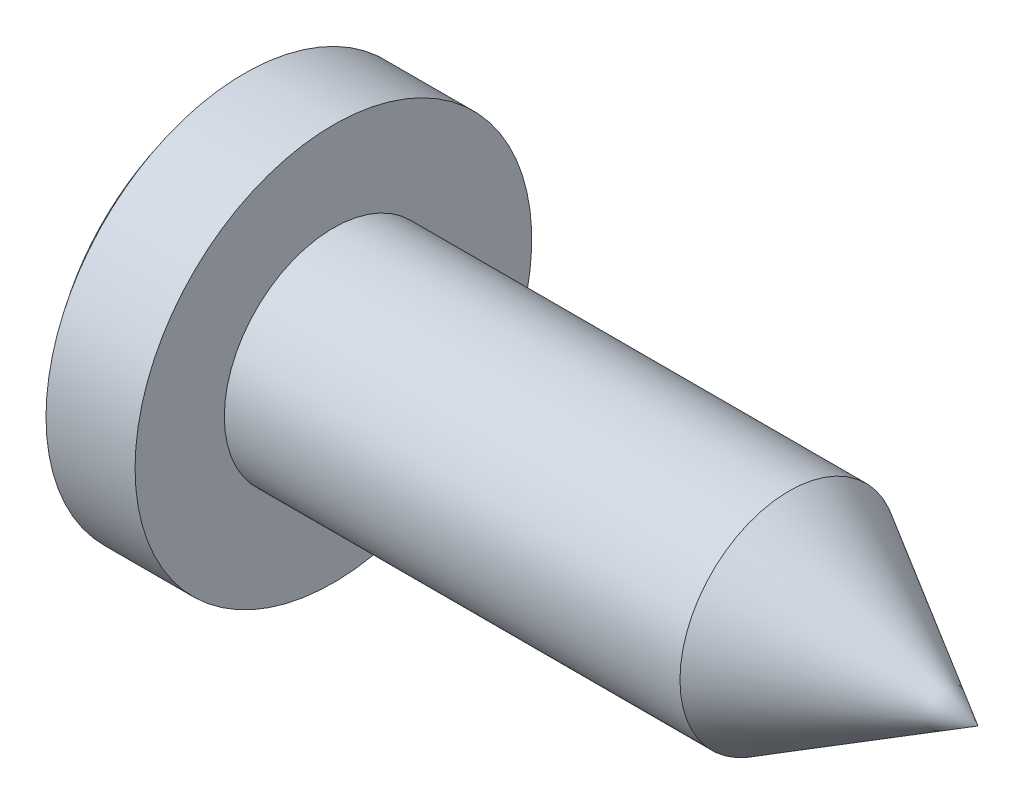
ISO-10303-21;
HEADER;
FILE_DESCRIPTION(('STEP AP214'),'2;1');
FILE_NAME('part.step','',(''),(''),'','','');
FILE_SCHEMA(('AUTOMOTIVE_DESIGN { 1 0 10303 214 1 1 1 1 }'));
ENDSEC;
DATA;
#1=APPLICATION_CONTEXT('core data for automotive mechanical design processes');
#2=APPLICATION_PROTOCOL_DEFINITION('international standard','automotive_design',2000,#1);
#3=PRODUCT_CONTEXT('',#1,'mechanical');
#4=PRODUCT('Part','Part','',(#3));
#5=PRODUCT_RELATED_PRODUCT_CATEGORY('part','',(#4));
#6=PRODUCT_DEFINITION_FORMATION('','',#4);
#7=PRODUCT_DEFINITION_CONTEXT('part definition',#1,'design');
#8=PRODUCT_DEFINITION('design','',#6,#7);
#9=PRODUCT_DEFINITION_SHAPE('','',#8);
#10=(LENGTH_UNIT() NAMED_UNIT(*) SI_UNIT(.MILLI.,.METRE.));
#11=(NAMED_UNIT(*) PLANE_ANGLE_UNIT() SI_UNIT($,.RADIAN.));
#12=(NAMED_UNIT(*) SI_UNIT($,.STERADIAN.) SOLID_ANGLE_UNIT());
#13=UNCERTAINTY_MEASURE_WITH_UNIT(LENGTH_MEASURE(1.E-05),#10,'distance_accuracy_value','');
#14=(GEOMETRIC_REPRESENTATION_CONTEXT(3) GLOBAL_UNCERTAINTY_ASSIGNED_CONTEXT((#13)) GLOBAL_UNIT_ASSIGNED_CONTEXT((#10,
#11,#12)) REPRESENTATION_CONTEXT('',''));
#15=CARTESIAN_POINT('',(0.,0.,0.));
#16=DIRECTION('',(0.,0.,1.));
#17=DIRECTION('',(1.,0.,0.));
#18=AXIS2_PLACEMENT_3D('',#15,#16,#17);
#19=CARTESIAN_POINT('',(1.6,0.,0.));
#20=DIRECTION('',(-1.,0.,0.));
#21=DIRECTION('',(0.,1.,0.));
#22=AXIS2_PLACEMENT_3D('',#19,#20,#21);
#23=SPHERICAL_SURFACE('',#22,3.2);
#24=CARTESIAN_POINT('',(-0.89799919935936,0.,0.));
#25=DIRECTION('',(-1.,0.,0.));
#26=DIRECTION('',(0.,0.,1.));
#27=AXIS2_PLACEMENT_3D('',#24,#25,#26);
#28=CIRCLE('',#27,2.);
#29=CARTESIAN_POINT('',(-0.89799919935936,0.,2.));
#30=VERTEX_POINT('',#29);
#31=EDGE_CURVE('E289',#30,#30,#28,.T.);
#32=ORIENTED_EDGE('',*,*,#31,.T.);
#33=EDGE_LOOP('',(#32));
#34=FACE_BOUND('',#33,.T.);
#35=CARTESIAN_POINT('',(1.56503616117409,0.0806815870157537,0.322726348063015));
#36=DIRECTION('',(0.104528463267654,-0.241206989505462,-0.964827958021851));
#37=DIRECTION('',(0.,0.970142500145332,-0.242535625036333));
#38=AXIS2_PLACEMENT_3D('',#35,#36,#37);
#39=CIRCLE('',#38,3.18247006517848);
#40=CARTESIAN_POINT('',(-1.45274996309991,0.934523397478773,-0.217677932639515));
#41=VERTEX_POINT('',#40);
#42=CARTESIAN_POINT('',(-1.54602165644221,0.569150220513997,-0.136439597205102));
#43=VERTEX_POINT('',#42);
#44=EDGE_CURVE('E11',#41,#43,#39,.F.);
#45=ORIENTED_EDGE('',*,*,#44,.F.);
#46=CARTESIAN_POINT('',(1.66379421431252,0.606961405040141,0.));
#47=DIRECTION('',(0.104528463267654,0.994521895368273,0.));
#48=DIRECTION('',(-0.994521895368273,0.104528463267654,0.));
#49=AXIS2_PLACEMENT_3D('',#46,#47,#48);
#50=CIRCLE('',#49,3.14126219074625);
#51=CARTESIAN_POINT('',(-1.45274996309991,0.934523397478773,0.217677932639514));
#52=VERTEX_POINT('',#51);
#53=EDGE_CURVE('E44',#52,#41,#50,.F.);
#54=ORIENTED_EDGE('',*,*,#53,.F.);
#55=CARTESIAN_POINT('',(1.56503616117409,0.0806815870157537,-0.322726348063015));
#56=DIRECTION('',(0.104528463267654,-0.241206989505462,0.964827958021851));
#57=DIRECTION('',(0.,-0.970142500145332,-0.242535625036333));
#58=AXIS2_PLACEMENT_3D('',#55,#56,#57);
#59=CIRCLE('',#58,3.18247006517848);
#60=CARTESIAN_POINT('',(-1.54602165644221,0.569150220513997,0.136439597205102));
#61=VERTEX_POINT('',#60);
#62=EDGE_CURVE('E329',#61,#52,#59,.F.);
#63=ORIENTED_EDGE('',*,*,#62,.F.);
#64=CARTESIAN_POINT('',(1.60749262454255,0.0356437803082174,0.061736838467657));
#65=DIRECTION('',(0.104528463267654,0.497260947684129,0.861281226008779));
#66=DIRECTION('',(0.,-0.866025403784443,0.499999999999992));
#67=AXIS2_PLACEMENT_3D('',#64,#65,#66);
#68=CIRCLE('',#67,3.19919707806175);
#69=CARTESIAN_POINT('',(-1.57234339721419,0.296847915734236,0.296847915734238));
#70=VERTEX_POINT('',#69);
#71=EDGE_CURVE('E327',#70,#61,#68,.F.);
#72=ORIENTED_EDGE('',*,*,#71,.F.);
#73=CARTESIAN_POINT('',(1.60749262454255,0.0617368384676551,0.0356437803082149));
#74=DIRECTION('',(0.104528463267654,0.861281226008787,0.497260947684114));
#75=DIRECTION('',(0.,-0.499999999999977,0.866025403784452));
#76=AXIS2_PLACEMENT_3D('',#73,#74,#75);
#77=CIRCLE('',#76,3.19919707806175);
#78=CARTESIAN_POINT('',(-1.54602165644221,0.136439597205108,0.569150220513995));
#79=VERTEX_POINT('',#78);
#80=EDGE_CURVE('E325',#79,#70,#77,.F.);
#81=ORIENTED_EDGE('',*,*,#80,.F.);
#82=CARTESIAN_POINT('',(1.56503616117409,-0.322726348063014,0.0806815870157571));
#83=DIRECTION('',(0.104528463267654,0.964827958021848,-0.241206989505473));
#84=DIRECTION('',(0.,0.242535625036343,0.970142500145329));
#85=AXIS2_PLACEMENT_3D('',#82,#83,#84);
#86=CIRCLE('',#85,3.18247006517848);
#87=CARTESIAN_POINT('',(-1.45274996309991,0.217677932639524,0.934523397478771));
#88=VERTEX_POINT('',#87);
#89=EDGE_CURVE('E323',#88,#79,#86,.F.);
#90=ORIENTED_EDGE('',*,*,#89,.F.);
#91=CARTESIAN_POINT('',(1.66379421431252,0.,0.606961405040141));
#92=DIRECTION('',(0.104528463267654,0.,0.994521895368273));
#93=DIRECTION('',(0.994521895368273,0.,-0.104528463267654));
#94=AXIS2_PLACEMENT_3D('',#91,#92,#93);
#95=CIRCLE('',#94,3.14126219074625);
#96=CARTESIAN_POINT('',(-1.45274996309991,-0.217677932639505,0.934523397478775));
#97=VERTEX_POINT('',#96);
#98=EDGE_CURVE('E321',#97,#88,#95,.F.);
#99=ORIENTED_EDGE('',*,*,#98,.F.);
#100=CARTESIAN_POINT('',(1.56503616117409,0.322726348063016,0.0806815870157503));
#101=DIRECTION('',(0.104528463267654,-0.964827958021853,-0.241206989505452));
#102=DIRECTION('',(0.,0.242535625036323,-0.970142500145334));
#103=AXIS2_PLACEMENT_3D('',#100,#101,#102);
#104=CIRCLE('',#103,3.18247006517848);
#105=CARTESIAN_POINT('',(-1.54602165644221,-0.136439597205096,0.569150220513998));
#106=VERTEX_POINT('',#105);
#107=EDGE_CURVE('E319',#106,#97,#104,.F.);
#108=ORIENTED_EDGE('',*,*,#107,.F.);
#109=CARTESIAN_POINT('',(1.60749262454255,-0.0617368384676559,0.0356437803082175));
#110=DIRECTION('',(0.104528463267654,-0.861281226008775,0.497260947684136));
#111=DIRECTION('',(0.,-0.499999999999999,-0.866025403784439));
#112=AXIS2_PLACEMENT_3D('',#109,#110,#111);
#113=CIRCLE('',#112,3.19919707806175);
#114=CARTESIAN_POINT('',(-1.57234339721419,-0.296847915734233,0.296847915734241));
#115=VERTEX_POINT('',#114);
#116=EDGE_CURVE('E317',#115,#106,#113,.F.);
#117=ORIENTED_EDGE('',*,*,#116,.F.);
#118=CARTESIAN_POINT('',(1.60749262454255,-0.035643780308217,0.0617368384676573));
#119=DIRECTION('',(0.104528463267654,-0.497260947684123,0.861281226008782));
#120=DIRECTION('',(0.,-0.866025403784447,-0.499999999999986));
#121=AXIS2_PLACEMENT_3D('',#118,#119,#120);
#122=CIRCLE('',#121,3.19919707806175);
#123=CARTESIAN_POINT('',(-1.54602165644221,-0.569150220513996,0.136439597205106));
#124=VERTEX_POINT('',#123);
#125=EDGE_CURVE('E315',#124,#115,#122,.F.);
#126=ORIENTED_EDGE('',*,*,#125,.F.);
#127=CARTESIAN_POINT('',(1.56503616117409,-0.0806815870157559,-0.322726348063015));
#128=DIRECTION('',(0.104528463267654,0.241206989505469,0.964827958021849));
#129=DIRECTION('',(0.,-0.97014250014533,0.242535625036339));
#130=AXIS2_PLACEMENT_3D('',#127,#128,#129);
#131=CIRCLE('',#130,3.18247006517848);
#132=CARTESIAN_POINT('',(-1.45274996309991,-0.934523397478772,0.217677932639521));
#133=VERTEX_POINT('',#132);
#134=EDGE_CURVE('E313',#133,#124,#131,.F.);
#135=ORIENTED_EDGE('',*,*,#134,.F.);
#136=CARTESIAN_POINT('',(1.66379421431252,-0.606961405040141,0.));
#137=DIRECTION('',(0.104528463267654,-0.994521895368273,0.));
#138=DIRECTION('',(0.994521895368273,0.104528463267654,0.));
#139=AXIS2_PLACEMENT_3D('',#136,#137,#138);
#140=CIRCLE('',#139,3.14126219074625);
#141=CARTESIAN_POINT('',(-1.45274996309991,-0.934523397478775,-0.217677932639508));
#142=VERTEX_POINT('',#141);
#143=EDGE_CURVE('E311',#142,#133,#140,.F.);
#144=ORIENTED_EDGE('',*,*,#143,.F.);
#145=CARTESIAN_POINT('',(1.56503616117409,-0.0806815870157514,0.322726348063016));
#146=DIRECTION('',(0.104528463267654,0.241206989505456,-0.964827958021853));
#147=DIRECTION('',(0.,0.970142500145334,0.242535625036326));
#148=AXIS2_PLACEMENT_3D('',#145,#146,#147);
#149=CIRCLE('',#148,3.18247006517848);
#150=CARTESIAN_POINT('',(-1.54602165644221,-0.569150220513998,-0.136439597205098));
#151=VERTEX_POINT('',#150);
#152=EDGE_CURVE('E309',#151,#142,#149,.F.);
#153=ORIENTED_EDGE('',*,*,#152,.F.);
#154=CARTESIAN_POINT('',(1.60749262454255,-0.0356437803082212,-0.0617368384676608));
#155=DIRECTION('',(0.104528463267654,-0.497260947684145,-0.861281226008769));
#156=DIRECTION('',(0.,0.866025403784434,-0.500000000000009));
#157=AXIS2_PLACEMENT_3D('',#154,#155,#156);
#158=CIRCLE('',#157,3.19919707806175);
#159=CARTESIAN_POINT('',(-1.57234339721419,-0.296847915734241,-0.296847915734239));
#160=VERTEX_POINT('',#159);
#161=EDGE_CURVE('E307',#160,#151,#158,.F.);
#162=ORIENTED_EDGE('',*,*,#161,.F.);
#163=CARTESIAN_POINT('',(1.60749262454255,-0.0617368384676612,-0.0356437803082206));
#164=DIRECTION('',(0.104528463267654,-0.861281226008774,-0.497260947684136));
#165=DIRECTION('',(0.,0.5,-0.866025403784439));
#166=AXIS2_PLACEMENT_3D('',#163,#164,#165);
#167=CIRCLE('',#166,3.19919707806175);
#168=CARTESIAN_POINT('',(-1.54602165644221,-0.136439597205104,-0.569150220513996));
#169=VERTEX_POINT('',#168);
#170=EDGE_CURVE('E305',#169,#160,#167,.F.);
#171=ORIENTED_EDGE('',*,*,#170,.F.);
#172=CARTESIAN_POINT('',(1.56503616117409,0.322726348063015,-0.0806815870157548));
#173=DIRECTION('',(0.104528463267654,-0.96482795802185,0.241206989505466));
#174=DIRECTION('',(0.,-0.242535625036336,-0.970142500145331));
#175=AXIS2_PLACEMENT_3D('',#172,#173,#174);
#176=CIRCLE('',#175,3.18247006517848);
#177=CARTESIAN_POINT('',(-1.45274996309991,-0.217677932639518,-0.934523397478772));
#178=VERTEX_POINT('',#177);
#179=EDGE_CURVE('E303',#178,#169,#176,.F.);
#180=ORIENTED_EDGE('',*,*,#179,.F.);
#181=CARTESIAN_POINT('',(1.66379421431252,0.,-0.606961405040141));
#182=DIRECTION('',(0.104528463267654,0.,-0.994521895368273));
#183=DIRECTION('',(-0.994521895368273,0.,-0.104528463267654));
#184=AXIS2_PLACEMENT_3D('',#181,#182,#183);
#185=CIRCLE('',#184,3.14126219074625);
#186=CARTESIAN_POINT('',(-1.45274996309991,0.217677932639511,-0.934523397478774));
#187=VERTEX_POINT('',#186);
#188=EDGE_CURVE('E301',#187,#178,#185,.F.);
#189=ORIENTED_EDGE('',*,*,#188,.F.);
#190=CARTESIAN_POINT('',(1.56503616117409,-0.322726348063015,-0.0806815870157525));
#191=DIRECTION('',(0.104528463267654,0.964827958021852,0.241206989505459));
#192=DIRECTION('',(0.,-0.242535625036329,0.970142500145333));
#193=AXIS2_PLACEMENT_3D('',#190,#191,#192);
#194=CIRCLE('',#193,3.18247006517848);
#195=CARTESIAN_POINT('',(-1.54602165644221,0.1364395972051,-0.569150220513997));
#196=VERTEX_POINT('',#195);
#197=EDGE_CURVE('E299',#196,#187,#194,.F.);
#198=ORIENTED_EDGE('',*,*,#197,.F.);
#199=CARTESIAN_POINT('',(1.60749262454255,0.0617368384676561,-0.035643780308217));
#200=DIRECTION('',(0.104528463267654,0.861281226008778,-0.497260947684129));
#201=DIRECTION('',(0.,0.499999999999993,0.866025403784443));
#202=AXIS2_PLACEMENT_3D('',#199,#200,#201);
#203=CIRCLE('',#202,3.19919707806175);
#204=CARTESIAN_POINT('',(-1.57234339721419,0.296847915734236,-0.296847915734239));
#205=VERTEX_POINT('',#204);
#206=EDGE_CURVE('E297',#205,#196,#203,.F.);
#207=ORIENTED_EDGE('',*,*,#206,.F.);
#208=CARTESIAN_POINT('',(1.60749262454255,0.0356437803082174,-0.061736838467657));
#209=DIRECTION('',(0.104528463267654,0.497260947684129,-0.861281226008779));
#210=DIRECTION('',(0.,0.866025403784443,0.499999999999992));
#211=AXIS2_PLACEMENT_3D('',#208,#209,#210);
#212=CIRCLE('',#211,3.19919707806175);
#213=EDGE_CURVE('E295',#43,#205,#212,.F.);
#214=ORIENTED_EDGE('',*,*,#213,.F.);
#215=EDGE_LOOP('',(#45,#54,#63,#72,#81,#90,#99,#108,#117,#126,#135,#144,#153,#162,#171,#180,
#189,#198,#207,#214));
#216=FACE_BOUND('',#215,.T.);
#217=ADVANCED_FACE('F36',(#34,#216),#23,.T.);
#218=CARTESIAN_POINT('',(0.,0.,0.));
#219=DIRECTION('',(-1.,0.,0.));
#220=DIRECTION('',(0.,0.,1.));
#221=AXIS2_PLACEMENT_3D('',#218,#219,#220);
#222=CYLINDRICAL_SURFACE('',#221,1.1);
#223=CARTESIAN_POINT('',(0.,0.,0.));
#224=DIRECTION('',(-1.,0.,0.));
#225=DIRECTION('',(0.,0.,1.));
#226=AXIS2_PLACEMENT_3D('',#223,#224,#225);
#227=CIRCLE('',#226,1.1);
#228=CARTESIAN_POINT('',(0.,0.,1.1));
#229=VERTEX_POINT('',#228);
#230=EDGE_CURVE('E196',#229,#229,#227,.T.);
#231=ORIENTED_EDGE('',*,*,#230,.F.);
#232=EDGE_LOOP('',(#231));
#233=FACE_BOUND('',#232,.T.);
#234=CARTESIAN_POINT('',(4.59474411167421,0.,0.));
#235=DIRECTION('',(-1.,0.,0.));
#236=DIRECTION('',(0.,0.,1.));
#237=AXIS2_PLACEMENT_3D('',#234,#235,#236);
#238=CIRCLE('',#237,1.1);
#239=CARTESIAN_POINT('',(4.59474411167421,0.,1.1));
#240=VERTEX_POINT('',#239);
#241=EDGE_CURVE('E192',#240,#240,#238,.T.);
#242=ORIENTED_EDGE('',*,*,#241,.T.);
#243=EDGE_LOOP('',(#242));
#244=FACE_BOUND('',#243,.T.);
#245=ADVANCED_FACE('F425',(#233,#244),#222,.T.);
#246=CARTESIAN_POINT('',(0.,1.1,0.));
#247=DIRECTION('',(-1.,0.,0.));
#248=DIRECTION('',(0.,0.,1.));
#249=AXIS2_PLACEMENT_3D('',#246,#247,#248);
#250=PLANE('',#249);
#251=CARTESIAN_POINT('',(0.,0.,0.));
#252=DIRECTION('',(-1.,0.,0.));
#253=DIRECTION('',(0.,0.,1.));
#254=AXIS2_PLACEMENT_3D('',#251,#252,#253);
#255=CIRCLE('',#254,2.);
#256=CARTESIAN_POINT('',(0.,0.,2.));
#257=VERTEX_POINT('',#256);
#258=EDGE_CURVE('E292',#257,#257,#255,.T.);
#259=ORIENTED_EDGE('',*,*,#258,.F.);
#260=EDGE_LOOP('',(#259));
#261=FACE_BOUND('',#260,.T.);
#262=ORIENTED_EDGE('',*,*,#230,.T.);
#263=EDGE_LOOP('',(#262));
#264=FACE_BOUND('',#263,.T.);
#265=ADVANCED_FACE('F38',(#261,#264),#250,.F.);
#266=CARTESIAN_POINT('',(0.,0.,0.));
#267=DIRECTION('',(-1.,0.,0.));
#268=DIRECTION('',(0.,0.,1.));
#269=AXIS2_PLACEMENT_3D('',#266,#267,#268);
#270=CYLINDRICAL_SURFACE('',#269,2.);
#271=ORIENTED_EDGE('',*,*,#31,.F.);
#272=EDGE_LOOP('',(#271));
#273=FACE_BOUND('',#272,.T.);
#274=ORIENTED_EDGE('',*,*,#258,.T.);
#275=EDGE_LOOP('',(#274));
#276=FACE_BOUND('',#275,.T.);
#277=ADVANCED_FACE('F434',(#273,#276),#270,.T.);
#278=CARTESIAN_POINT('',(4.59474411167421,0.,0.));
#279=DIRECTION('',(-1.,0.,0.));
#280=DIRECTION('',(0.,0.,1.));
#281=AXIS2_PLACEMENT_3D('',#278,#279,#280);
#282=CONICAL_SURFACE('',#281,1.1,0.523598775598293);
#283=CARTESIAN_POINT('',(6.5,0.,0.));
#284=VERTEX_POINT('',#283);
#285=VERTEX_LOOP('',#284);
#286=FACE_BOUND('',#285,.T.);
#287=ORIENTED_EDGE('',*,*,#241,.F.);
#288=EDGE_LOOP('',(#287));
#289=FACE_BOUND('',#288,.T.);
#290=ADVANCED_FACE('F436',(#286,#289),#282,.T.);
#291=CARTESIAN_POINT('',(-1.6,0.95,-0.2375));
#292=DIRECTION('',(0.104528463267654,-0.241206989505462,-0.964827958021851));
#293=DIRECTION('',(0.,0.970142500145332,-0.242535625036333));
#294=AXIS2_PLACEMENT_3D('',#291,#292,#293);
#295=PLANE('',#294);
#296=ORIENTED_EDGE('',*,*,#44,.T.);
#297=DIRECTION('',(-0.993634572314887,0.0156427600493606,-0.111560032084303));
#298=VECTOR('',#297,1.);
#299=CARTESIAN_POINT('',(-1.6,0.57,-0.1425));
#300=LINE('',#299,#298);
#301=CARTESIAN_POINT('',(-0.75,0.556618474827239,-0.0470664976705276));
#302=VERTEX_POINT('',#301);
#303=EDGE_CURVE('E51',#302,#43,#300,.T.);
#304=ORIENTED_EDGE('',*,*,#303,.F.);
#305=DIRECTION('',(0.,-0.970142500145332,0.242535625036333));
#306=VECTOR('',#305,1.);
#307=CARTESIAN_POINT('',(-0.75,0.0216677931850071,0.0866711727400304));
#308=LINE('',#307,#306);
#309=CARTESIAN_POINT('',(-0.75,0.860661400024174,-0.123077228969761));
#310=VERTEX_POINT('',#309);
#311=EDGE_CURVE('E176',#302,#310,#308,.F.);
#312=ORIENTED_EDGE('',*,*,#311,.T.);
#313=DIRECTION('',(-0.985727427293419,0.103604127426078,-0.132693722013437));
#314=VECTOR('',#313,1.);
#315=CARTESIAN_POINT('',(-1.53787007542131,0.943469881790042,-0.229136378665655));
#316=LINE('',#315,#314);
#317=EDGE_CURVE('E187',#310,#41,#316,.T.);
#318=ORIENTED_EDGE('',*,*,#317,.T.);
#319=EDGE_LOOP('',(#296,#304,#312,#318));
#320=FACE_BOUND('',#319,.T.);
#321=ADVANCED_FACE('F186',(#320),#295,.F.);
#322=CARTESIAN_POINT('',(-1.6,0.95,0.2375));
#323=DIRECTION('',(0.104528463267654,0.994521895368273,0.));
#324=DIRECTION('',(-0.994521895368273,0.104528463267654,0.));
#325=AXIS2_PLACEMENT_3D('',#322,#323,#324);
#326=PLANE('',#325);
#327=ORIENTED_EDGE('',*,*,#53,.T.);
#328=ORIENTED_EDGE('',*,*,#317,.F.);
#329=DIRECTION('',(0.,0.,-1.));
#330=VECTOR('',#329,1.);
#331=CARTESIAN_POINT('',(-0.75,0.860661400024175,0.));
#332=LINE('',#331,#330);
#333=CARTESIAN_POINT('',(-0.75,0.860661400024174,0.123077228969761));
#334=VERTEX_POINT('',#333);
#335=EDGE_CURVE('E172',#310,#334,#332,.F.);
#336=ORIENTED_EDGE('',*,*,#335,.T.);
#337=DIRECTION('',(-0.985727427293419,0.103604127426078,0.132693722013437));
#338=VECTOR('',#337,1.);
#339=CARTESIAN_POINT('',(-1.6,0.95,0.2375));
#340=LINE('',#339,#338);
#341=EDGE_CURVE('E193',#334,#52,#340,.T.);
#342=ORIENTED_EDGE('',*,*,#341,.T.);
#343=EDGE_LOOP('',(#327,#328,#336,#342));
#344=FACE_BOUND('',#343,.T.);
#345=ADVANCED_FACE('F190',(#344),#326,.F.);
#346=CARTESIAN_POINT('',(-1.6,0.95,0.2375));
#347=DIRECTION('',(0.104528463267654,-0.241206989505462,0.964827958021851));
#348=DIRECTION('',(0.,-0.970142500145332,-0.242535625036333));
#349=AXIS2_PLACEMENT_3D('',#346,#347,#348);
#350=PLANE('',#349);
#351=ORIENTED_EDGE('',*,*,#62,.T.);
#352=ORIENTED_EDGE('',*,*,#341,.F.);
#353=DIRECTION('',(0.,0.970142500145332,0.242535625036333));
#354=VECTOR('',#353,1.);
#355=CARTESIAN_POINT('',(-0.75,0.0216677931850069,-0.0866711727400304));
#356=LINE('',#355,#354);
#357=CARTESIAN_POINT('',(-0.75,0.556618474827239,0.0470664976705276));
#358=VERTEX_POINT('',#357);
#359=EDGE_CURVE('E178',#334,#358,#356,.F.);
#360=ORIENTED_EDGE('',*,*,#359,.T.);
#361=DIRECTION('',(-0.993634572314887,0.0156427600493606,0.111560032084303));
#362=VECTOR('',#361,1.);
#363=CARTESIAN_POINT('',(-1.61643715208567,0.57025876960518,0.14434547646101));
#364=LINE('',#363,#362);
#365=EDGE_CURVE('E198',#358,#61,#364,.T.);
#366=ORIENTED_EDGE('',*,*,#365,.T.);
#367=EDGE_LOOP('',(#351,#352,#360,#366));
#368=FACE_BOUND('',#367,.T.);
#369=ADVANCED_FACE('F332',(#368),#350,.F.);
#370=CARTESIAN_POINT('',(-1.6,0.57,0.1425));
#371=DIRECTION('',(0.104528463267654,0.497260947684129,0.861281226008779));
#372=DIRECTION('',(0.,-0.866025403784443,0.499999999999992));
#373=AXIS2_PLACEMENT_3D('',#370,#371,#372);
#374=PLANE('',#373);
#375=ORIENTED_EDGE('',*,*,#71,.T.);
#376=ORIENTED_EDGE('',*,*,#365,.F.);
#377=DIRECTION('',(0.,0.866025403784443,-0.499999999999992));
#378=VECTOR('',#377,1.);
#379=CARTESIAN_POINT('',(-0.75,0.159535010031724,0.276322742960963));
#380=LINE('',#379,#378);
#381=CARTESIAN_POINT('',(-0.75,0.233575465858467,0.233575465858471));
#382=VERTEX_POINT('',#381);
#383=EDGE_CURVE('E254',#358,#382,#380,.F.);
#384=ORIENTED_EDGE('',*,*,#383,.T.);
#385=DIRECTION('',(-0.994132040497618,0.0764901498757915,0.0764901498757902));
#386=VECTOR('',#385,1.);
#387=CARTESIAN_POINT('',(-1.60871040111109,0.299646052667046,0.299646052667049));
#388=LINE('',#387,#386);
#389=EDGE_CURVE('E248',#382,#70,#388,.T.);
#390=ORIENTED_EDGE('',*,*,#389,.T.);
#391=EDGE_LOOP('',(#375,#376,#384,#390));
#392=FACE_BOUND('',#391,.T.);
#393=ADVANCED_FACE('F415',(#392),#374,.F.);
#394=CARTESIAN_POINT('',(-1.6,0.142500000000006,0.569999999999998));
#395=DIRECTION('',(0.104528463267654,0.861281226008787,0.497260947684114));
#396=DIRECTION('',(0.,-0.499999999999977,0.866025403784452));
#397=AXIS2_PLACEMENT_3D('',#394,#395,#396);
#398=PLANE('',#397);
#399=ORIENTED_EDGE('',*,*,#80,.T.);
#400=ORIENTED_EDGE('',*,*,#389,.F.);
#401=DIRECTION('',(0.,0.499999999999977,-0.866025403784452));
#402=VECTOR('',#401,1.);
#403=CARTESIAN_POINT('',(-0.75,0.276322742960963,0.159535010031718));
#404=LINE('',#403,#402);
#405=CARTESIAN_POINT('',(-0.75,0.0470664976705335,0.556618474827239));
#406=VERTEX_POINT('',#405);
#407=EDGE_CURVE('E256',#382,#406,#404,.F.);
#408=ORIENTED_EDGE('',*,*,#407,.T.);
#409=DIRECTION('',(-0.993634572314886,0.111560032084303,0.015642760049359));
#410=VECTOR('',#409,1.);
#411=CARTESIAN_POINT('',(-1.6,0.142500000000006,0.569999999999998));
#412=LINE('',#411,#410);
#413=EDGE_CURVE('E245',#406,#79,#412,.T.);
#414=ORIENTED_EDGE('',*,*,#413,.T.);
#415=EDGE_LOOP('',(#399,#400,#408,#414));
#416=FACE_BOUND('',#415,.T.);
#417=ADVANCED_FACE('F412',(#416),#398,.F.);
#418=CARTESIAN_POINT('',(-1.6,0.23750000000001,0.949999999999997));
#419=DIRECTION('',(0.104528463267654,0.964827958021848,-0.241206989505473));
#420=DIRECTION('',(0.,0.242535625036343,0.970142500145329));
#421=AXIS2_PLACEMENT_3D('',#418,#419,#420);
#422=PLANE('',#421);
#423=ORIENTED_EDGE('',*,*,#89,.T.);
#424=ORIENTED_EDGE('',*,*,#413,.F.);
#425=DIRECTION('',(0.,-0.242535625036343,-0.970142500145329));
#426=VECTOR('',#425,1.);
#427=CARTESIAN_POINT('',(-0.75,-0.0866711727400301,0.0216677931850079));
#428=LINE('',#427,#426);
#429=CARTESIAN_POINT('',(-0.75,0.12307722896977,0.860661400024173));
#430=VERTEX_POINT('',#429);
#431=EDGE_CURVE('E258',#406,#430,#428,.F.);
#432=ORIENTED_EDGE('',*,*,#431,.T.);
#433=DIRECTION('',(-0.985727427293419,0.132693722013438,0.103604127426076));
#434=VECTOR('',#433,1.);
#435=CARTESIAN_POINT('',(-1.53787007542131,0.229136378665665,0.94346988179004));
#436=LINE('',#435,#434);
#437=EDGE_CURVE('E242',#430,#88,#436,.T.);
#438=ORIENTED_EDGE('',*,*,#437,.T.);
#439=EDGE_LOOP('',(#423,#424,#432,#438));
#440=FACE_BOUND('',#439,.T.);
#441=ADVANCED_FACE('F409',(#440),#422,.F.);
#442=CARTESIAN_POINT('',(-1.6,-0.23749999999999,0.950000000000002));
#443=DIRECTION('',(0.104528463267654,0.,0.994521895368273));
#444=DIRECTION('',(0.994521895368273,0.,-0.104528463267654));
#445=AXIS2_PLACEMENT_3D('',#442,#443,#444);
#446=PLANE('',#445);
#447=ORIENTED_EDGE('',*,*,#98,.T.);
#448=ORIENTED_EDGE('',*,*,#437,.F.);
#449=DIRECTION('',(0.,1.,0.));
#450=VECTOR('',#449,1.);
#451=CARTESIAN_POINT('',(-0.75,0.,0.860661400024174));
#452=LINE('',#451,#450);
#453=CARTESIAN_POINT('',(-0.75,-0.123077228969752,0.860661400024176));
#454=VERTEX_POINT('',#453);
#455=EDGE_CURVE('E260',#430,#454,#452,.F.);
#456=ORIENTED_EDGE('',*,*,#455,.T.);
#457=DIRECTION('',(-0.985727427293419,-0.132693722013436,0.103604127426079));
#458=VECTOR('',#457,1.);
#459=CARTESIAN_POINT('',(-1.6,-0.23749999999999,0.950000000000002));
#460=LINE('',#459,#458);
#461=EDGE_CURVE('E239',#454,#97,#460,.T.);
#462=ORIENTED_EDGE('',*,*,#461,.T.);
#463=EDGE_LOOP('',(#447,#448,#456,#462));
#464=FACE_BOUND('',#463,.T.);
#465=ADVANCED_FACE('F402',(#464),#446,.F.);
#466=CARTESIAN_POINT('',(-1.6,-0.23749999999999,0.950000000000002));
#467=DIRECTION('',(0.104528463267654,-0.964827958021853,-0.241206989505452));
#468=DIRECTION('',(0.,0.242535625036323,-0.970142500145334));
#469=AXIS2_PLACEMENT_3D('',#466,#467,#468);
#470=PLANE('',#469);
#471=ORIENTED_EDGE('',*,*,#107,.T.);
#472=ORIENTED_EDGE('',*,*,#461,.F.);
#473=DIRECTION('',(0.,-0.242535625036323,0.970142500145334));
#474=VECTOR('',#473,1.);
#475=CARTESIAN_POINT('',(-0.75,0.0866711727400305,0.0216677931850063));
#476=LINE('',#475,#474);
#477=CARTESIAN_POINT('',(-0.75,-0.0470664976705218,0.55661847482724));
#478=VERTEX_POINT('',#477);
#479=EDGE_CURVE('E262',#454,#478,#476,.F.);
#480=ORIENTED_EDGE('',*,*,#479,.T.);
#481=DIRECTION('',(-0.993634572314887,-0.111560032084303,0.0156427600493616));
#482=VECTOR('',#481,1.);
#483=CARTESIAN_POINT('',(-1.61643715208567,-0.144345476461004,0.570258769605181));
#484=LINE('',#483,#482);
#485=EDGE_CURVE('E236',#478,#106,#484,.T.);
#486=ORIENTED_EDGE('',*,*,#485,.T.);
#487=EDGE_LOOP('',(#471,#472,#480,#486));
#488=FACE_BOUND('',#487,.T.);
#489=ADVANCED_FACE('F400',(#488),#470,.F.);
#490=CARTESIAN_POINT('',(-1.6,-0.142499999999994,0.570000000000001));
#491=DIRECTION('',(0.104528463267654,-0.861281226008775,0.497260947684136));
#492=DIRECTION('',(0.,-0.499999999999999,-0.866025403784439));
#493=AXIS2_PLACEMENT_3D('',#490,#491,#492);
#494=PLANE('',#493);
#495=ORIENTED_EDGE('',*,*,#116,.T.);
#496=ORIENTED_EDGE('',*,*,#485,.F.);
#497=DIRECTION('',(0.,0.499999999999999,0.866025403784439));
#498=VECTOR('',#497,1.);
#499=CARTESIAN_POINT('',(-0.75,-0.276322742960961,0.159535010031725));
#500=LINE('',#499,#498);
#501=CARTESIAN_POINT('',(-0.75,-0.233575465858466,0.233575465858472));
#502=VERTEX_POINT('',#501);
#503=EDGE_CURVE('E264',#478,#502,#500,.F.);
#504=ORIENTED_EDGE('',*,*,#503,.T.);
#505=DIRECTION('',(-0.994132040497618,-0.07649014987579,0.0764901498757912));
#506=VECTOR('',#505,1.);
#507=CARTESIAN_POINT('',(-1.60871040111109,-0.299646052667044,0.299646052667052));
#508=LINE('',#507,#506);
#509=EDGE_CURVE('E233',#502,#115,#508,.T.);
#510=ORIENTED_EDGE('',*,*,#509,.T.);
#511=EDGE_LOOP('',(#495,#496,#504,#510));
#512=FACE_BOUND('',#511,.T.);
#513=ADVANCED_FACE('F393',(#512),#494,.F.);
#514=CARTESIAN_POINT('',(-1.6,-0.569999999999999,0.142500000000004));
#515=DIRECTION('',(0.104528463267654,-0.497260947684123,0.861281226008782));
#516=DIRECTION('',(0.,-0.866025403784447,-0.499999999999986));
#517=AXIS2_PLACEMENT_3D('',#514,#515,#516);
#518=PLANE('',#517);
#519=ORIENTED_EDGE('',*,*,#125,.T.);
#520=ORIENTED_EDGE('',*,*,#509,.F.);
#521=DIRECTION('',(0.,0.866025403784447,0.499999999999986));
#522=VECTOR('',#521,1.);
#523=CARTESIAN_POINT('',(-0.75,-0.159535010031723,0.276322742960963));
#524=LINE('',#523,#522);
#525=CARTESIAN_POINT('',(-0.75,-0.556618474827239,0.0470664976705315));
#526=VERTEX_POINT('',#525);
#527=EDGE_CURVE('E266',#502,#526,#524,.F.);
#528=ORIENTED_EDGE('',*,*,#527,.T.);
#529=DIRECTION('',(-0.993634572314887,-0.0156427600493598,0.111560032084303));
#530=VECTOR('',#529,1.);
#531=CARTESIAN_POINT('',(-1.6,-0.569999999999999,0.142500000000004));
#532=LINE('',#531,#530);
#533=EDGE_CURVE('E230',#526,#124,#532,.T.);
#534=ORIENTED_EDGE('',*,*,#533,.T.);
#535=EDGE_LOOP('',(#519,#520,#528,#534));
#536=FACE_BOUND('',#535,.T.);
#537=ADVANCED_FACE('F390',(#536),#518,.F.);
#538=CARTESIAN_POINT('',(-1.6,-0.949999999999998,0.237500000000007));
#539=DIRECTION('',(0.104528463267654,0.241206989505469,0.964827958021849));
#540=DIRECTION('',(0.,-0.97014250014533,0.242535625036339));
#541=AXIS2_PLACEMENT_3D('',#538,#539,#540);
#542=PLANE('',#541);
#543=ORIENTED_EDGE('',*,*,#134,.T.);
#544=ORIENTED_EDGE('',*,*,#533,.F.);
#545=DIRECTION('',(0.,0.97014250014533,-0.242535625036339));
#546=VECTOR('',#545,1.);
#547=CARTESIAN_POINT('',(-0.75,-0.0216677931850086,-0.0866711727400299));
#548=LINE('',#547,#546);
#549=CARTESIAN_POINT('',(-0.75,-0.860661400024174,0.123077228969767));
#550=VERTEX_POINT('',#549);
#551=EDGE_CURVE('E268',#526,#550,#548,.F.);
#552=ORIENTED_EDGE('',*,*,#551,.T.);
#553=DIRECTION('',(-0.985727427293419,-0.103604127426077,0.132693722013438));
#554=VECTOR('',#553,1.);
#555=CARTESIAN_POINT('',(-1.53787007542131,-0.943469881790041,0.229136378665662));
#556=LINE('',#555,#554);
#557=EDGE_CURVE('E227',#550,#133,#556,.T.);
#558=ORIENTED_EDGE('',*,*,#557,.T.);
#559=EDGE_LOOP('',(#543,#544,#552,#558));
#560=FACE_BOUND('',#559,.T.);
#561=ADVANCED_FACE('F382',(#560),#542,.F.);
#562=CARTESIAN_POINT('',(-1.6,-0.950000000000001,-0.237499999999994));
#563=DIRECTION('',(0.104528463267654,-0.994521895368273,0.));
#564=DIRECTION('',(0.994521895368273,0.104528463267654,0.));
#565=AXIS2_PLACEMENT_3D('',#562,#563,#564);
#566=PLANE('',#565);
#567=ORIENTED_EDGE('',*,*,#143,.T.);
#568=ORIENTED_EDGE('',*,*,#557,.F.);
#569=DIRECTION('',(0.,0.,1.));
#570=VECTOR('',#569,1.);
#571=CARTESIAN_POINT('',(-0.75,-0.860661400024175,0.));
#572=LINE('',#571,#570);
#573=CARTESIAN_POINT('',(-0.75,-0.860661400024175,-0.123077228969755));
#574=VERTEX_POINT('',#573);
#575=EDGE_CURVE('E270',#550,#574,#572,.F.);
#576=ORIENTED_EDGE('',*,*,#575,.T.);
#577=DIRECTION('',(-0.985727427293419,-0.103604127426079,-0.132693722013436));
#578=VECTOR('',#577,1.);
#579=CARTESIAN_POINT('',(-1.6,-0.950000000000001,-0.237499999999994));
#580=LINE('',#579,#578);
#581=EDGE_CURVE('E224',#574,#142,#580,.T.);
#582=ORIENTED_EDGE('',*,*,#581,.T.);
#583=EDGE_LOOP('',(#567,#568,#576,#582));
#584=FACE_BOUND('',#583,.T.);
#585=ADVANCED_FACE('F380',(#584),#566,.F.);
#586=CARTESIAN_POINT('',(-1.6,-0.950000000000001,-0.237499999999994));
#587=DIRECTION('',(0.104528463267654,0.241206989505456,-0.964827958021853));
#588=DIRECTION('',(0.,0.970142500145334,0.242535625036326));
#589=AXIS2_PLACEMENT_3D('',#586,#587,#588);
#590=PLANE('',#589);
#591=ORIENTED_EDGE('',*,*,#152,.T.);
#592=ORIENTED_EDGE('',*,*,#581,.F.);
#593=DIRECTION('',(0.,-0.970142500145334,-0.242535625036326));
#594=VECTOR('',#593,1.);
#595=CARTESIAN_POINT('',(-0.75,-0.0216677931850076,0.0866711727400303));
#596=LINE('',#595,#594);
#597=CARTESIAN_POINT('',(-0.75,-0.556618474827239,-0.0470664976705235));
#598=VERTEX_POINT('',#597);
#599=EDGE_CURVE('E272',#574,#598,#596,.F.);
#600=ORIENTED_EDGE('',*,*,#599,.T.);
#601=DIRECTION('',(-0.993634572314887,-0.015642760049362,-0.111560032084303));
#602=VECTOR('',#601,1.);
#603=CARTESIAN_POINT('',(-1.61643715208567,-0.570258769605181,-0.144345476461006));
#604=LINE('',#603,#602);
#605=EDGE_CURVE('E221',#598,#151,#604,.T.);
#606=ORIENTED_EDGE('',*,*,#605,.T.);
#607=EDGE_LOOP('',(#591,#592,#600,#606));
#608=FACE_BOUND('',#607,.T.);
#609=ADVANCED_FACE('F373',(#608),#590,.F.);
#610=CARTESIAN_POINT('',(-1.6,-0.570000000000001,-0.142499999999996));
#611=DIRECTION('',(0.104528463267654,-0.497260947684145,-0.861281226008769));
#612=DIRECTION('',(0.,0.866025403784434,-0.500000000000009));
#613=AXIS2_PLACEMENT_3D('',#610,#611,#612);
#614=PLANE('',#613);
#615=ORIENTED_EDGE('',*,*,#161,.T.);
#616=ORIENTED_EDGE('',*,*,#605,.F.);
#617=DIRECTION('',(0.,-0.866025403784434,0.500000000000009));
#618=VECTOR('',#617,1.);
#619=CARTESIAN_POINT('',(-0.75,-0.159535010031732,-0.276322742960964));
#620=LINE('',#619,#618);
#621=CARTESIAN_POINT('',(-0.75,-0.233575465858474,-0.233575465858471));
#622=VERTEX_POINT('',#621);
#623=EDGE_CURVE('E274',#598,#622,#620,.F.);
#624=ORIENTED_EDGE('',*,*,#623,.T.);
#625=DIRECTION('',(-0.994132040497618,-0.0764901498757908,-0.07649014987579));
#626=VECTOR('',#625,1.);
#627=CARTESIAN_POINT('',(-1.60871040111109,-0.299646052667052,-0.299646052667049));
#628=LINE('',#627,#626);
#629=EDGE_CURVE('E218',#622,#160,#628,.T.);
#630=ORIENTED_EDGE('',*,*,#629,.T.);
#631=EDGE_LOOP('',(#615,#616,#624,#630));
#632=FACE_BOUND('',#631,.T.);
#633=ADVANCED_FACE('F370',(#632),#614,.F.);
#634=CARTESIAN_POINT('',(-1.6,-0.142500000000002,-0.569999999999999));
#635=DIRECTION('',(0.104528463267654,-0.861281226008774,-0.497260947684136));
#636=DIRECTION('',(0.,0.5,-0.866025403784439));
#637=AXIS2_PLACEMENT_3D('',#634,#635,#636);
#638=PLANE('',#637);
#639=ORIENTED_EDGE('',*,*,#170,.T.);
#640=ORIENTED_EDGE('',*,*,#629,.F.);
#641=DIRECTION('',(0.,-0.5,0.866025403784439));
#642=VECTOR('',#641,1.);
#643=CARTESIAN_POINT('',(-0.75,-0.276322742960966,-0.159535010031729));
#644=LINE('',#643,#642);
#645=CARTESIAN_POINT('',(-0.75,-0.0470664976705294,-0.556618474827239));
#646=VERTEX_POINT('',#645);
#647=EDGE_CURVE('E276',#622,#646,#644,.F.);
#648=ORIENTED_EDGE('',*,*,#647,.T.);
#649=DIRECTION('',(-0.993634572314887,-0.111560032084303,-0.0156427600493609));
#650=VECTOR('',#649,1.);
#651=CARTESIAN_POINT('',(-1.6,-0.142500000000002,-0.569999999999999));
#652=LINE('',#651,#650);
#653=EDGE_CURVE('E215',#646,#169,#652,.T.);
#654=ORIENTED_EDGE('',*,*,#653,.T.);
#655=EDGE_LOOP('',(#639,#640,#648,#654));
#656=FACE_BOUND('',#655,.T.);
#657=ADVANCED_FACE('F362',(#656),#638,.F.);
#658=CARTESIAN_POINT('',(-1.6,-0.237500000000003,-0.949999999999999));
#659=DIRECTION('',(0.104528463267654,-0.96482795802185,0.241206989505466));
#660=DIRECTION('',(0.,-0.242535625036336,-0.970142500145331));
#661=AXIS2_PLACEMENT_3D('',#658,#659,#660);
#662=PLANE('',#661);
#663=ORIENTED_EDGE('',*,*,#179,.T.);
#664=ORIENTED_EDGE('',*,*,#653,.F.);
#665=DIRECTION('',(0.,0.242535625036336,0.970142500145331));
#666=VECTOR('',#665,1.);
#667=CARTESIAN_POINT('',(-0.75,0.08667117274003,-0.0216677931850084));
#668=LINE('',#667,#666);
#669=CARTESIAN_POINT('',(-0.75,-0.123077228969764,-0.860661400024174));
#670=VERTEX_POINT('',#669);
#671=EDGE_CURVE('E278',#646,#670,#668,.F.);
#672=ORIENTED_EDGE('',*,*,#671,.T.);
#673=DIRECTION('',(-0.985727427293419,-0.132693722013437,-0.103604127426077));
#674=VECTOR('',#673,1.);
#675=CARTESIAN_POINT('',(-1.53787007542131,-0.229136378665658,-0.943469881790042));
#676=LINE('',#675,#674);
#677=EDGE_CURVE('E212',#670,#178,#676,.T.);
#678=ORIENTED_EDGE('',*,*,#677,.T.);
#679=EDGE_LOOP('',(#663,#664,#672,#678));
#680=FACE_BOUND('',#679,.T.);
#681=ADVANCED_FACE('F360',(#680),#662,.F.);
#682=CARTESIAN_POINT('',(-1.6,0.237499999999997,-0.950000000000001));
#683=DIRECTION('',(0.104528463267654,0.,-0.994521895368273));
#684=DIRECTION('',(-0.994521895368273,0.,-0.104528463267654));
#685=AXIS2_PLACEMENT_3D('',#682,#683,#684);
#686=PLANE('',#685);
#687=ORIENTED_EDGE('',*,*,#188,.T.);
#688=ORIENTED_EDGE('',*,*,#677,.F.);
#689=DIRECTION('',(0.,-1.,0.));
#690=VECTOR('',#689,1.);
#691=CARTESIAN_POINT('',(-0.75,0.,-0.860661400024174));
#692=LINE('',#691,#690);
#693=CARTESIAN_POINT('',(-0.75,0.123077228969758,-0.860661400024175));
#694=VERTEX_POINT('',#693);
#695=EDGE_CURVE('E280',#670,#694,#692,.F.);
#696=ORIENTED_EDGE('',*,*,#695,.T.);
#697=DIRECTION('',(-0.985727427293418,0.132693722013436,-0.103604127426078));
#698=VECTOR('',#697,1.);
#699=CARTESIAN_POINT('',(-1.6,0.237499999999997,-0.950000000000001));
#700=LINE('',#699,#698);
#701=EDGE_CURVE('E209',#694,#187,#700,.T.);
#702=ORIENTED_EDGE('',*,*,#701,.T.);
#703=EDGE_LOOP('',(#687,#688,#696,#702));
#704=FACE_BOUND('',#703,.T.);
#705=ADVANCED_FACE('F353',(#704),#686,.F.);
#706=CARTESIAN_POINT('',(-1.6,0.237499999999997,-0.950000000000001));
#707=DIRECTION('',(0.104528463267654,0.964827958021852,0.241206989505459));
#708=DIRECTION('',(0.,-0.242535625036329,0.970142500145333));
#709=AXIS2_PLACEMENT_3D('',#706,#707,#708);
#710=PLANE('',#709);
#711=ORIENTED_EDGE('',*,*,#197,.T.);
#712=ORIENTED_EDGE('',*,*,#701,.F.);
#713=DIRECTION('',(0.,0.242535625036329,-0.970142500145333));
#714=VECTOR('',#713,1.);
#715=CARTESIAN_POINT('',(-0.75,-0.0866711727400303,-0.0216677931850075));
#716=LINE('',#715,#714);
#717=CARTESIAN_POINT('',(-0.75,0.0470664976705257,-0.55661847482724));
#718=VERTEX_POINT('',#717);
#719=EDGE_CURVE('E282',#694,#718,#716,.F.);
#720=ORIENTED_EDGE('',*,*,#719,.T.);
#721=DIRECTION('',(-0.993634572314887,0.111560032084303,-0.0156427600493608));
#722=VECTOR('',#721,1.);
#723=CARTESIAN_POINT('',(-1.61643715208567,0.144345476461008,-0.57025876960518));
#724=LINE('',#723,#722);
#725=EDGE_CURVE('E206',#718,#196,#724,.T.);
#726=ORIENTED_EDGE('',*,*,#725,.T.);
#727=EDGE_LOOP('',(#711,#712,#720,#726));
#728=FACE_BOUND('',#727,.T.);
#729=ADVANCED_FACE('F350',(#728),#710,.F.);
#730=CARTESIAN_POINT('',(-1.6,0.142499999999998,-0.57));
#731=DIRECTION('',(0.104528463267654,0.861281226008778,-0.497260947684129));
#732=DIRECTION('',(0.,0.499999999999993,0.866025403784443));
#733=AXIS2_PLACEMENT_3D('',#730,#731,#732);
#734=PLANE('',#733);
#735=ORIENTED_EDGE('',*,*,#206,.T.);
#736=ORIENTED_EDGE('',*,*,#725,.F.);
#737=DIRECTION('',(0.,-0.499999999999993,-0.866025403784443));
#738=VECTOR('',#737,1.);
#739=CARTESIAN_POINT('',(-0.75,0.276322742960961,-0.159535010031725));
#740=LINE('',#739,#738);
#741=CARTESIAN_POINT('',(-0.75,0.233575465858468,-0.233575465858471));
#742=VERTEX_POINT('',#741);
#743=EDGE_CURVE('E284',#718,#742,#740,.F.);
#744=ORIENTED_EDGE('',*,*,#743,.T.);
#745=DIRECTION('',(-0.994132040497618,0.0764901498757906,-0.0764901498757907));
#746=VECTOR('',#745,1.);
#747=CARTESIAN_POINT('',(-1.60871040111109,0.299646052667046,-0.299646052667049));
#748=LINE('',#747,#746);
#749=EDGE_CURVE('E202',#742,#205,#748,.T.);
#750=ORIENTED_EDGE('',*,*,#749,.T.);
#751=EDGE_LOOP('',(#735,#736,#744,#750));
#752=FACE_BOUND('',#751,.T.);
#753=ADVANCED_FACE('F342',(#752),#734,.F.);
#754=CARTESIAN_POINT('',(-1.6,0.57,-0.1425));
#755=DIRECTION('',(0.104528463267654,0.497260947684129,-0.861281226008779));
#756=DIRECTION('',(0.,0.866025403784443,0.499999999999992));
#757=AXIS2_PLACEMENT_3D('',#754,#755,#756);
#758=PLANE('',#757);
#759=ORIENTED_EDGE('',*,*,#213,.T.);
#760=ORIENTED_EDGE('',*,*,#749,.F.);
#761=DIRECTION('',(0.,-0.866025403784443,-0.499999999999992));
#762=VECTOR('',#761,1.);
#763=CARTESIAN_POINT('',(-0.75,0.159535010031724,-0.276322742960963));
#764=LINE('',#763,#762);
#765=EDGE_CURVE('E203',#742,#302,#764,.F.);
#766=ORIENTED_EDGE('',*,*,#765,.T.);
#767=ORIENTED_EDGE('',*,*,#303,.T.);
#768=EDGE_LOOP('',(#759,#760,#766,#767));
#769=FACE_BOUND('',#768,.T.);
#770=ADVANCED_FACE('F340',(#769),#758,.F.);
#771=CARTESIAN_POINT('',(-0.75,0.,0.));
#772=DIRECTION('',(-1.,0.,0.));
#773=DIRECTION('',(0.,0.,1.));
#774=AXIS2_PLACEMENT_3D('',#771,#772,#773);
#775=PLANE('',#774);
#776=ORIENTED_EDGE('',*,*,#311,.F.);
#777=ORIENTED_EDGE('',*,*,#765,.F.);
#778=ORIENTED_EDGE('',*,*,#743,.F.);
#779=ORIENTED_EDGE('',*,*,#719,.F.);
#780=ORIENTED_EDGE('',*,*,#695,.F.);
#781=ORIENTED_EDGE('',*,*,#671,.F.);
#782=ORIENTED_EDGE('',*,*,#647,.F.);
#783=ORIENTED_EDGE('',*,*,#623,.F.);
#784=ORIENTED_EDGE('',*,*,#599,.F.);
#785=ORIENTED_EDGE('',*,*,#575,.F.);
#786=ORIENTED_EDGE('',*,*,#551,.F.);
#787=ORIENTED_EDGE('',*,*,#527,.F.);
#788=ORIENTED_EDGE('',*,*,#503,.F.);
#789=ORIENTED_EDGE('',*,*,#479,.F.);
#790=ORIENTED_EDGE('',*,*,#455,.F.);
#791=ORIENTED_EDGE('',*,*,#431,.F.);
#792=ORIENTED_EDGE('',*,*,#407,.F.);
#793=ORIENTED_EDGE('',*,*,#383,.F.);
#794=ORIENTED_EDGE('',*,*,#359,.F.);
#795=ORIENTED_EDGE('',*,*,#335,.F.);
#796=EDGE_LOOP('',(#776,#777,#778,#779,#780,#781,#782,#783,#784,#785,#786,#787,#788,#789,#790,
#791,#792,#793,#794,#795));
#797=FACE_BOUND('',#796,.T.);
#798=ADVANCED_FACE('F174',(#797),#775,.T.);
#799=CLOSED_SHELL('',(#217,#245,#265,#277,#290,#321,#345,#369,#393,#417,#441,#465,#489,#513,
#537,#561,#585,#609,#633,#657,#681,#705,#729,#753,#770,#798));
#800=MANIFOLD_SOLID_BREP('B2',#799);
#801=ADVANCED_BREP_SHAPE_REPRESENTATION('',(#18,#800),#14);
#802=SHAPE_DEFINITION_REPRESENTATION(#9,#801);
ENDSEC;
END-ISO-10303-21;
